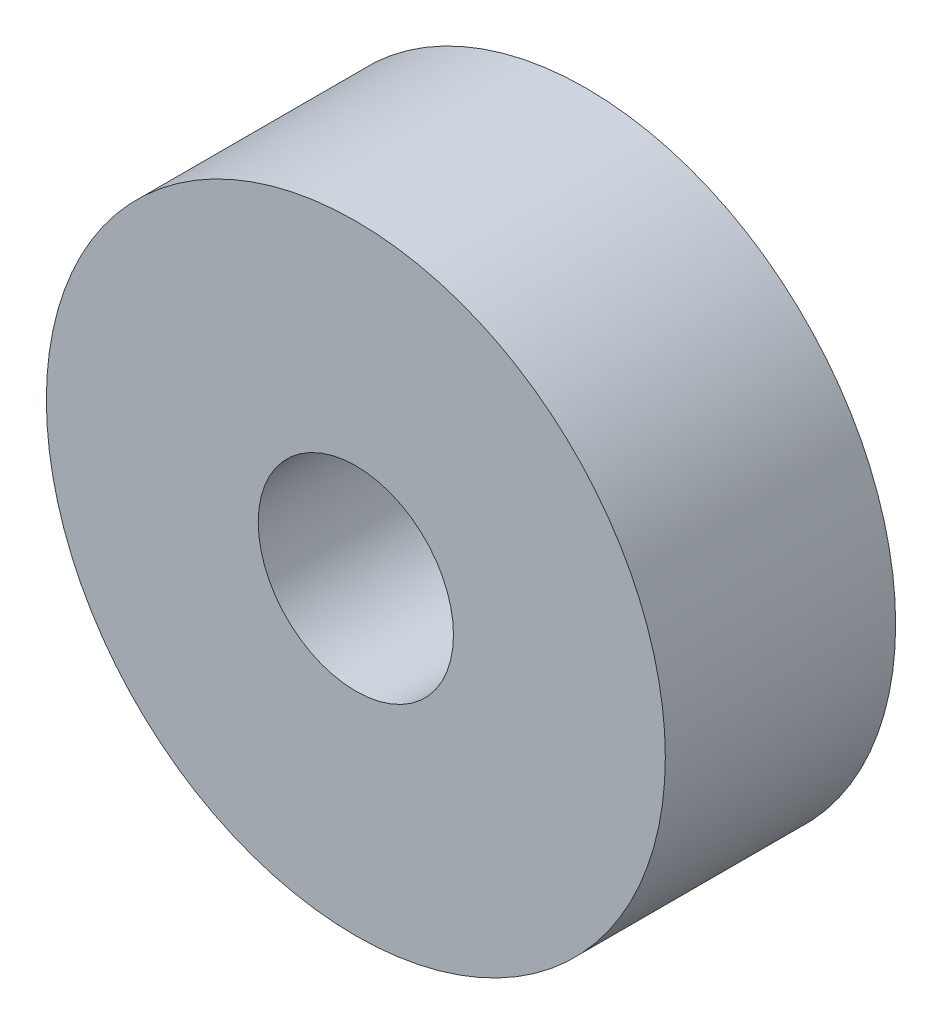
ISO-10303-21;
HEADER;
FILE_DESCRIPTION(('STEP AP214'),'2;1');
FILE_NAME('part.step','',(''),(''),'','','');
FILE_SCHEMA(('AUTOMOTIVE_DESIGN { 1 0 10303 214 1 1 1 1 }'));
ENDSEC;
DATA;
#1=APPLICATION_CONTEXT('core data for automotive mechanical design processes');
#2=APPLICATION_PROTOCOL_DEFINITION('international standard','automotive_design',2000,#1);
#3=PRODUCT_CONTEXT('',#1,'mechanical');
#4=PRODUCT('Part','Part','',(#3));
#5=PRODUCT_RELATED_PRODUCT_CATEGORY('part','',(#4));
#6=PRODUCT_DEFINITION_FORMATION('','',#4);
#7=PRODUCT_DEFINITION_CONTEXT('part definition',#1,'design');
#8=PRODUCT_DEFINITION('design','',#6,#7);
#9=PRODUCT_DEFINITION_SHAPE('','',#8);
#10=(LENGTH_UNIT() NAMED_UNIT(*) SI_UNIT(.MILLI.,.METRE.));
#11=(NAMED_UNIT(*) PLANE_ANGLE_UNIT() SI_UNIT($,.RADIAN.));
#12=(NAMED_UNIT(*) SI_UNIT($,.STERADIAN.) SOLID_ANGLE_UNIT());
#13=UNCERTAINTY_MEASURE_WITH_UNIT(LENGTH_MEASURE(1.E-05),#10,'distance_accuracy_value','');
#14=(GEOMETRIC_REPRESENTATION_CONTEXT(3) GLOBAL_UNCERTAINTY_ASSIGNED_CONTEXT((#13)) GLOBAL_UNIT_ASSIGNED_CONTEXT((#10,
#11,#12)) REPRESENTATION_CONTEXT('',''));
#15=CARTESIAN_POINT('',(0.,0.,0.));
#16=DIRECTION('',(0.,0.,1.));
#17=DIRECTION('',(1.,0.,0.));
#18=AXIS2_PLACEMENT_3D('',#15,#16,#17);
#19=CARTESIAN_POINT('',(0.,0.,11.176));
#20=DIRECTION('',(0.,0.,1.));
#21=DIRECTION('',(1.,0.,0.));
#22=AXIS2_PLACEMENT_3D('',#19,#20,#21);
#23=PLANE('',#22);
#24=CARTESIAN_POINT('',(0.,0.,11.176));
#25=DIRECTION('',(0.,0.,1.));
#26=DIRECTION('',(1.,0.,0.));
#27=AXIS2_PLACEMENT_3D('',#24,#25,#26);
#28=CIRCLE('',#27,15.01775);
#29=CARTESIAN_POINT('',(15.01775,0.,11.176));
#30=VERTEX_POINT('',#29);
#31=EDGE_CURVE('E10',#30,#30,#28,.T.);
#32=ORIENTED_EDGE('',*,*,#31,.T.);
#33=EDGE_LOOP('',(#32));
#34=FACE_BOUND('',#33,.T.);
#35=CARTESIAN_POINT('',(0.,0.,11.176));
#36=DIRECTION('',(0.,0.,1.));
#37=DIRECTION('',(1.,0.,0.));
#38=AXIS2_PLACEMENT_3D('',#35,#36,#37);
#39=CIRCLE('',#38,4.7371);
#40=CARTESIAN_POINT('',(4.7371,0.,11.176));
#41=VERTEX_POINT('',#40);
#42=EDGE_CURVE('E42',#41,#41,#39,.T.);
#43=ORIENTED_EDGE('',*,*,#42,.F.);
#44=EDGE_LOOP('',(#43));
#45=FACE_BOUND('',#44,.T.);
#46=ADVANCED_FACE('F31',(#34,#45),#23,.T.);
#47=CARTESIAN_POINT('',(0.,0.,0.));
#48=DIRECTION('',(0.,0.,1.));
#49=DIRECTION('',(1.,0.,0.));
#50=AXIS2_PLACEMENT_3D('',#47,#48,#49);
#51=PLANE('',#50);
#52=CARTESIAN_POINT('',(0.,0.,0.));
#53=DIRECTION('',(0.,0.,1.));
#54=DIRECTION('',(1.,0.,0.));
#55=AXIS2_PLACEMENT_3D('',#52,#53,#54);
#56=CIRCLE('',#55,15.01775);
#57=CARTESIAN_POINT('',(15.01775,0.,0.));
#58=VERTEX_POINT('',#57);
#59=EDGE_CURVE('E35',#58,#58,#56,.T.);
#60=ORIENTED_EDGE('',*,*,#59,.F.);
#61=EDGE_LOOP('',(#60));
#62=FACE_BOUND('',#61,.T.);
#63=CARTESIAN_POINT('',(0.,0.,0.));
#64=DIRECTION('',(0.,0.,1.));
#65=DIRECTION('',(1.,0.,0.));
#66=AXIS2_PLACEMENT_3D('',#63,#64,#65);
#67=CIRCLE('',#66,4.7371);
#68=CARTESIAN_POINT('',(4.7371,0.,0.));
#69=VERTEX_POINT('',#68);
#70=EDGE_CURVE('E44',#69,#69,#67,.T.);
#71=ORIENTED_EDGE('',*,*,#70,.T.);
#72=EDGE_LOOP('',(#71));
#73=FACE_BOUND('',#72,.T.);
#74=ADVANCED_FACE('F54',(#62,#73),#51,.F.);
#75=CARTESIAN_POINT('',(0.,0.,11.176));
#76=DIRECTION('',(0.,0.,-1.));
#77=DIRECTION('',(-1.,0.,0.));
#78=AXIS2_PLACEMENT_3D('',#75,#76,#77);
#79=CYLINDRICAL_SURFACE('',#78,15.01775);
#80=ORIENTED_EDGE('',*,*,#31,.F.);
#81=EDGE_LOOP('',(#80));
#82=FACE_BOUND('',#81,.T.);
#83=ORIENTED_EDGE('',*,*,#59,.T.);
#84=EDGE_LOOP('',(#83));
#85=FACE_BOUND('',#84,.T.);
#86=ADVANCED_FACE('F33',(#82,#85),#79,.T.);
#87=CARTESIAN_POINT('',(0.,0.,11.176));
#88=DIRECTION('',(0.,0.,-1.));
#89=DIRECTION('',(-1.,0.,0.));
#90=AXIS2_PLACEMENT_3D('',#87,#88,#89);
#91=CYLINDRICAL_SURFACE('',#90,4.7371);
#92=ORIENTED_EDGE('',*,*,#42,.T.);
#93=EDGE_LOOP('',(#92));
#94=FACE_BOUND('',#93,.T.);
#95=ORIENTED_EDGE('',*,*,#70,.F.);
#96=EDGE_LOOP('',(#95));
#97=FACE_BOUND('',#96,.T.);
#98=ADVANCED_FACE('F50',(#94,#97),#91,.F.);
#99=CLOSED_SHELL('',(#46,#74,#86,#98));
#100=MANIFOLD_SOLID_BREP('B2',#99);
#101=ADVANCED_BREP_SHAPE_REPRESENTATION('',(#18,#100),#14);
#102=SHAPE_DEFINITION_REPRESENTATION(#9,#101);
ENDSEC;
END-ISO-10303-21;
